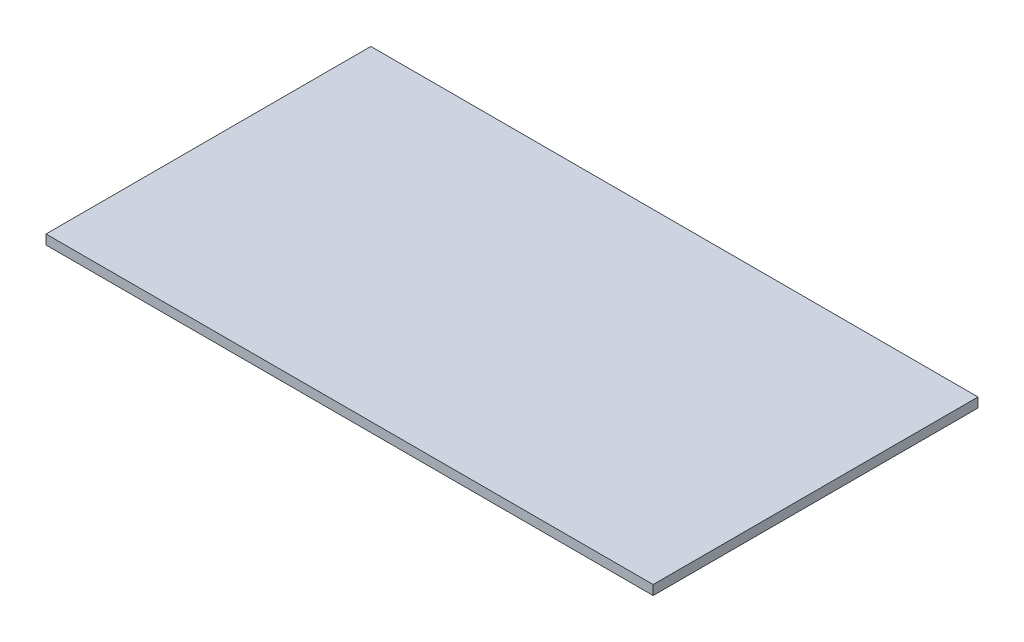
ISO-10303-21;
HEADER;
FILE_DESCRIPTION(('STEP AP214'),'2;1');
FILE_NAME('part.step','',(''),(''),'','','');
FILE_SCHEMA(('AUTOMOTIVE_DESIGN { 1 0 10303 214 1 1 1 1 }'));
ENDSEC;
DATA;
#1=APPLICATION_CONTEXT('core data for automotive mechanical design processes');
#2=APPLICATION_PROTOCOL_DEFINITION('international standard','automotive_design',2000,#1);
#3=PRODUCT_CONTEXT('',#1,'mechanical');
#4=PRODUCT('Part','Part','',(#3));
#5=PRODUCT_RELATED_PRODUCT_CATEGORY('part','',(#4));
#6=PRODUCT_DEFINITION_FORMATION('','',#4);
#7=PRODUCT_DEFINITION_CONTEXT('part definition',#1,'design');
#8=PRODUCT_DEFINITION('design','',#6,#7);
#9=PRODUCT_DEFINITION_SHAPE('','',#8);
#10=(LENGTH_UNIT() NAMED_UNIT(*) SI_UNIT(.MILLI.,.METRE.));
#11=(NAMED_UNIT(*) PLANE_ANGLE_UNIT() SI_UNIT($,.RADIAN.));
#12=(NAMED_UNIT(*) SI_UNIT($,.STERADIAN.) SOLID_ANGLE_UNIT());
#13=UNCERTAINTY_MEASURE_WITH_UNIT(LENGTH_MEASURE(1.E-05),#10,'distance_accuracy_value','');
#14=(GEOMETRIC_REPRESENTATION_CONTEXT(3) GLOBAL_UNCERTAINTY_ASSIGNED_CONTEXT((#13)) GLOBAL_UNIT_ASSIGNED_CONTEXT((#10,
#11,#12)) REPRESENTATION_CONTEXT('',''));
#15=CARTESIAN_POINT('',(0.,0.,0.));
#16=DIRECTION('',(0.,0.,1.));
#17=DIRECTION('',(1.,0.,0.));
#18=AXIS2_PLACEMENT_3D('',#15,#16,#17);
#19=CARTESIAN_POINT('',(-7.952,0.25,-4.24));
#20=DIRECTION('',(1.,0.,0.));
#21=DIRECTION('',(0.,0.,-1.));
#22=AXIS2_PLACEMENT_3D('',#19,#20,#21);
#23=PLANE('',#22);
#24=DIRECTION('',(0.,0.,1.));
#25=VECTOR('',#24,1.);
#26=CARTESIAN_POINT('',(-7.952,0.,-4.24));
#27=LINE('',#26,#25);
#28=CARTESIAN_POINT('',(-7.952,0.,-4.24));
#29=VERTEX_POINT('',#28);
#30=CARTESIAN_POINT('',(-7.952,0.,4.24));
#31=VERTEX_POINT('',#30);
#32=EDGE_CURVE('E100',#29,#31,#27,.T.);
#33=ORIENTED_EDGE('',*,*,#32,.T.);
#34=DIRECTION('',(0.,-1.,0.));
#35=VECTOR('',#34,1.);
#36=CARTESIAN_POINT('',(-7.952,0.25,4.24));
#37=LINE('',#36,#35);
#38=CARTESIAN_POINT('',(-7.952,0.25,4.24));
#39=VERTEX_POINT('',#38);
#40=EDGE_CURVE('E11',#39,#31,#37,.T.);
#41=ORIENTED_EDGE('',*,*,#40,.F.);
#42=DIRECTION('',(0.,0.,1.));
#43=VECTOR('',#42,1.);
#44=CARTESIAN_POINT('',(-7.952,0.25,-4.24));
#45=LINE('',#44,#43);
#46=CARTESIAN_POINT('',(-7.952,0.25,-4.24));
#47=VERTEX_POINT('',#46);
#48=EDGE_CURVE('E86',#47,#39,#45,.T.);
#49=ORIENTED_EDGE('',*,*,#48,.F.);
#50=DIRECTION('',(0.,-1.,0.));
#51=VECTOR('',#50,1.);
#52=CARTESIAN_POINT('',(-7.952,0.25,-4.24));
#53=LINE('',#52,#51);
#54=EDGE_CURVE('E96',#47,#29,#53,.T.);
#55=ORIENTED_EDGE('',*,*,#54,.T.);
#56=EDGE_LOOP('',(#33,#41,#49,#55));
#57=FACE_BOUND('',#56,.T.);
#58=ADVANCED_FACE('F36',(#57),#23,.F.);
#59=CARTESIAN_POINT('',(-7.952,0.25,4.24));
#60=DIRECTION('',(0.,0.,-1.));
#61=DIRECTION('',(-1.,0.,0.));
#62=AXIS2_PLACEMENT_3D('',#59,#60,#61);
#63=PLANE('',#62);
#64=DIRECTION('',(1.,0.,0.));
#65=VECTOR('',#64,1.);
#66=CARTESIAN_POINT('',(-7.952,0.,4.24));
#67=LINE('',#66,#65);
#68=CARTESIAN_POINT('',(7.898,0.,4.24));
#69=VERTEX_POINT('',#68);
#70=EDGE_CURVE('E91',#31,#69,#67,.T.);
#71=ORIENTED_EDGE('',*,*,#70,.T.);
#72=DIRECTION('',(0.,-1.,0.));
#73=VECTOR('',#72,1.);
#74=CARTESIAN_POINT('',(7.898,0.25,4.24));
#75=LINE('',#74,#73);
#76=CARTESIAN_POINT('',(7.898,0.25,4.24));
#77=VERTEX_POINT('',#76);
#78=EDGE_CURVE('E44',#77,#69,#75,.T.);
#79=ORIENTED_EDGE('',*,*,#78,.F.);
#80=DIRECTION('',(1.,0.,0.));
#81=VECTOR('',#80,1.);
#82=CARTESIAN_POINT('',(-7.952,0.25,4.24));
#83=LINE('',#82,#81);
#84=EDGE_CURVE('E80',#39,#77,#83,.T.);
#85=ORIENTED_EDGE('',*,*,#84,.F.);
#86=ORIENTED_EDGE('',*,*,#40,.T.);
#87=EDGE_LOOP('',(#71,#79,#85,#86));
#88=FACE_BOUND('',#87,.T.);
#89=ADVANCED_FACE('F90',(#88),#63,.F.);
#90=CARTESIAN_POINT('',(7.898,0.25,4.24));
#91=DIRECTION('',(-1.,0.,0.));
#92=DIRECTION('',(0.,0.,1.));
#93=AXIS2_PLACEMENT_3D('',#90,#91,#92);
#94=PLANE('',#93);
#95=DIRECTION('',(0.,0.,-1.));
#96=VECTOR('',#95,1.);
#97=CARTESIAN_POINT('',(7.898,0.,4.24));
#98=LINE('',#97,#96);
#99=CARTESIAN_POINT('',(7.898,0.,-4.24));
#100=VERTEX_POINT('',#99);
#101=EDGE_CURVE('E104',#69,#100,#98,.T.);
#102=ORIENTED_EDGE('',*,*,#101,.T.);
#103=DIRECTION('',(0.,-1.,0.));
#104=VECTOR('',#103,1.);
#105=CARTESIAN_POINT('',(7.898,0.25,-4.24));
#106=LINE('',#105,#104);
#107=CARTESIAN_POINT('',(7.898,0.25,-4.24));
#108=VERTEX_POINT('',#107);
#109=EDGE_CURVE('E93',#108,#100,#106,.T.);
#110=ORIENTED_EDGE('',*,*,#109,.F.);
#111=DIRECTION('',(0.,0.,-1.));
#112=VECTOR('',#111,1.);
#113=CARTESIAN_POINT('',(7.898,0.25,4.24));
#114=LINE('',#113,#112);
#115=EDGE_CURVE('E83',#77,#108,#114,.T.);
#116=ORIENTED_EDGE('',*,*,#115,.F.);
#117=ORIENTED_EDGE('',*,*,#78,.T.);
#118=EDGE_LOOP('',(#102,#110,#116,#117));
#119=FACE_BOUND('',#118,.T.);
#120=ADVANCED_FACE('F94',(#119),#94,.F.);
#121=CARTESIAN_POINT('',(0.,0.25,-4.24));
#122=DIRECTION('',(0.,0.,1.));
#123=DIRECTION('',(1.,0.,0.));
#124=AXIS2_PLACEMENT_3D('',#121,#122,#123);
#125=PLANE('',#124);
#126=DIRECTION('',(-1.,0.,0.));
#127=VECTOR('',#126,1.);
#128=CARTESIAN_POINT('',(0.,0.,-4.24));
#129=LINE('',#128,#127);
#130=EDGE_CURVE('E69',#100,#29,#129,.T.);
#131=ORIENTED_EDGE('',*,*,#130,.T.);
#132=ORIENTED_EDGE('',*,*,#54,.F.);
#133=DIRECTION('',(-1.,0.,0.));
#134=VECTOR('',#133,1.);
#135=CARTESIAN_POINT('',(7.898,0.25,-4.24));
#136=LINE('',#135,#134);
#137=EDGE_CURVE('E52',#108,#47,#136,.T.);
#138=ORIENTED_EDGE('',*,*,#137,.F.);
#139=ORIENTED_EDGE('',*,*,#109,.T.);
#140=EDGE_LOOP('',(#131,#132,#138,#139));
#141=FACE_BOUND('',#140,.T.);
#142=ADVANCED_FACE('F108',(#141),#125,.F.);
#143=CARTESIAN_POINT('',(0.,0.25,0.));
#144=DIRECTION('',(0.,1.,0.));
#145=DIRECTION('',(0.,0.,1.));
#146=AXIS2_PLACEMENT_3D('',#143,#144,#145);
#147=PLANE('',#146);
#148=ORIENTED_EDGE('',*,*,#48,.T.);
#149=ORIENTED_EDGE('',*,*,#84,.T.);
#150=ORIENTED_EDGE('',*,*,#115,.T.);
#151=ORIENTED_EDGE('',*,*,#137,.T.);
#152=EDGE_LOOP('',(#148,#149,#150,#151));
#153=FACE_BOUND('',#152,.T.);
#154=ADVANCED_FACE('F81',(#153),#147,.T.);
#155=CARTESIAN_POINT('',(0.,0.,0.));
#156=DIRECTION('',(0.,1.,0.));
#157=DIRECTION('',(0.,0.,1.));
#158=AXIS2_PLACEMENT_3D('',#155,#156,#157);
#159=PLANE('',#158);
#160=ORIENTED_EDGE('',*,*,#32,.F.);
#161=ORIENTED_EDGE('',*,*,#130,.F.);
#162=ORIENTED_EDGE('',*,*,#101,.F.);
#163=ORIENTED_EDGE('',*,*,#70,.F.);
#164=EDGE_LOOP('',(#160,#161,#162,#163));
#165=FACE_BOUND('',#164,.T.);
#166=ADVANCED_FACE('F110',(#165),#159,.F.);
#167=CLOSED_SHELL('',(#58,#89,#120,#142,#154,#166));
#168=MANIFOLD_SOLID_BREP('B2',#167);
#169=ADVANCED_BREP_SHAPE_REPRESENTATION('',(#18,#168),#14);
#170=SHAPE_DEFINITION_REPRESENTATION(#9,#169);
ENDSEC;
END-ISO-10303-21;
